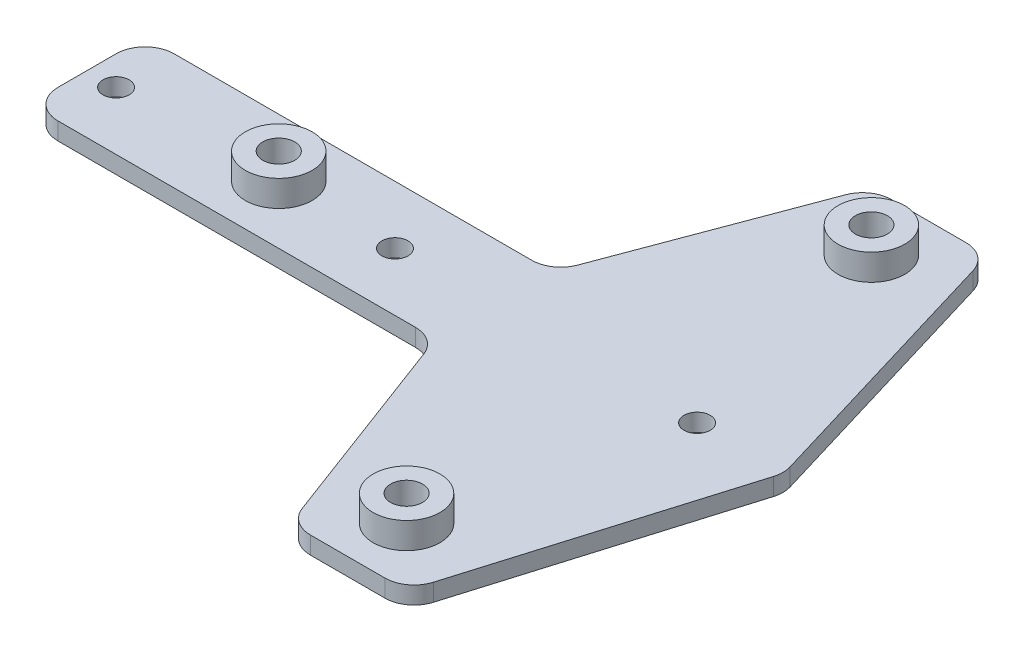
ISO-10303-21;
HEADER;
FILE_DESCRIPTION(('STEP AP214'),'2;1');
FILE_NAME('part.step','',(''),(''),'','','');
FILE_SCHEMA(('AUTOMOTIVE_DESIGN { 1 0 10303 214 1 1 1 1 }'));
ENDSEC;
DATA;
#1=APPLICATION_CONTEXT('core data for automotive mechanical design processes');
#2=APPLICATION_PROTOCOL_DEFINITION('international standard','automotive_design',2000,#1);
#3=PRODUCT_CONTEXT('',#1,'mechanical');
#4=PRODUCT('Part','Part','',(#3));
#5=PRODUCT_RELATED_PRODUCT_CATEGORY('part','',(#4));
#6=PRODUCT_DEFINITION_FORMATION('','',#4);
#7=PRODUCT_DEFINITION_CONTEXT('part definition',#1,'design');
#8=PRODUCT_DEFINITION('design','',#6,#7);
#9=PRODUCT_DEFINITION_SHAPE('','',#8);
#10=(LENGTH_UNIT() NAMED_UNIT(*) SI_UNIT(.MILLI.,.METRE.));
#11=(NAMED_UNIT(*) PLANE_ANGLE_UNIT() SI_UNIT($,.RADIAN.));
#12=(NAMED_UNIT(*) SI_UNIT($,.STERADIAN.) SOLID_ANGLE_UNIT());
#13=UNCERTAINTY_MEASURE_WITH_UNIT(LENGTH_MEASURE(1.E-05),#10,'distance_accuracy_value','');
#14=(GEOMETRIC_REPRESENTATION_CONTEXT(3) GLOBAL_UNCERTAINTY_ASSIGNED_CONTEXT((#13)) GLOBAL_UNIT_ASSIGNED_CONTEXT((#10,
#11,#12)) REPRESENTATION_CONTEXT('',''));
#15=CARTESIAN_POINT('',(0.,0.,0.));
#16=DIRECTION('',(0.,0.,1.));
#17=DIRECTION('',(1.,0.,0.));
#18=AXIS2_PLACEMENT_3D('',#15,#16,#17);
#19=CARTESIAN_POINT('',(6.53499765917655,3.,-15.));
#20=DIRECTION('',(0.,1.,0.));
#21=DIRECTION('',(0.,0.,1.));
#22=AXIS2_PLACEMENT_3D('',#19,#20,#21);
#23=PLANE('',#22);
#24=CARTESIAN_POINT('',(-55.,3.,0.));
#25=DIRECTION('',(0.,1.,0.));
#26=DIRECTION('',(0.,0.,1.));
#27=AXIS2_PLACEMENT_3D('',#24,#25,#26);
#28=CIRCLE('',#27,2.25);
#29=CARTESIAN_POINT('',(-55.,3.,2.25));
#30=VERTEX_POINT('',#29);
#31=EDGE_CURVE('E399',#30,#30,#28,.T.);
#32=ORIENTED_EDGE('',*,*,#31,.F.);
#33=EDGE_LOOP('',(#32));
#34=FACE_BOUND('',#33,.T.);
#35=CARTESIAN_POINT('',(45.,3.,0.));
#36=DIRECTION('',(0.,1.,0.));
#37=DIRECTION('',(0.,0.,1.));
#38=AXIS2_PLACEMENT_3D('',#35,#36,#37);
#39=CIRCLE('',#38,2.25);
#40=CARTESIAN_POINT('',(45.,3.,2.25));
#41=VERTEX_POINT('',#40);
#42=EDGE_CURVE('E400',#41,#41,#39,.T.);
#43=ORIENTED_EDGE('',*,*,#42,.F.);
#44=EDGE_LOOP('',(#43));
#45=FACE_BOUND('',#44,.T.);
#46=CARTESIAN_POINT('',(-7.,3.,0.));
#47=DIRECTION('',(0.,1.,0.));
#48=DIRECTION('',(0.,0.,1.));
#49=AXIS2_PLACEMENT_3D('',#46,#47,#48);
#50=CIRCLE('',#49,2.25);
#51=CARTESIAN_POINT('',(-7.,3.,2.25));
#52=VERTEX_POINT('',#51);
#53=EDGE_CURVE('E410',#52,#52,#50,.T.);
#54=ORIENTED_EDGE('',*,*,#53,.F.);
#55=EDGE_LOOP('',(#54));
#56=FACE_BOUND('',#55,.T.);
#57=CARTESIAN_POINT('',(35.,3.,-40.));
#58=DIRECTION('',(0.,1.,0.));
#59=DIRECTION('',(0.,0.,1.));
#60=AXIS2_PLACEMENT_3D('',#57,#58,#59);
#61=CIRCLE('',#60,5.74999999999999);
#62=CARTESIAN_POINT('',(35.,3.,-34.25));
#63=VERTEX_POINT('',#62);
#64=EDGE_CURVE('E425',#63,#63,#61,.T.);
#65=ORIENTED_EDGE('',*,*,#64,.F.);
#66=EDGE_LOOP('',(#65));
#67=FACE_BOUND('',#66,.T.);
#68=CARTESIAN_POINT('',(6.53499765917655,3.,-15.));
#69=DIRECTION('',(0.,-1.,0.));
#70=DIRECTION('',(0.,0.,1.));
#71=AXIS2_PLACEMENT_3D('',#68,#69,#70);
#72=CIRCLE('',#71,5.);
#73=CARTESIAN_POINT('',(11.2166435470218,3.,-13.244382792058));
#74=VERTEX_POINT('',#73);
#75=CARTESIAN_POINT('',(6.53499765917655,3.,-10.));
#76=VERTEX_POINT('',#75);
#77=EDGE_CURVE('E228',#74,#76,#72,.T.);
#78=ORIENTED_EDGE('',*,*,#77,.T.);
#79=DIRECTION('',(-1.,0.,0.));
#80=VECTOR('',#79,1.);
#81=CARTESIAN_POINT('',(-55.,3.,-10.));
#82=LINE('',#81,#80);
#83=CARTESIAN_POINT('',(-55.,3.,-10.));
#84=VERTEX_POINT('',#83);
#85=EDGE_CURVE('E126',#76,#84,#82,.T.);
#86=ORIENTED_EDGE('',*,*,#85,.T.);
#87=CARTESIAN_POINT('',(-55.,3.,-5.));
#88=DIRECTION('',(0.,1.,0.));
#89=DIRECTION('',(0.,0.,1.));
#90=AXIS2_PLACEMENT_3D('',#87,#88,#89);
#91=CIRCLE('',#90,5.);
#92=CARTESIAN_POINT('',(-60.,3.,-5.));
#93=VERTEX_POINT('',#92);
#94=EDGE_CURVE('E273',#84,#93,#91,.T.);
#95=ORIENTED_EDGE('',*,*,#94,.T.);
#96=DIRECTION('',(0.,0.,1.));
#97=VECTOR('',#96,1.);
#98=CARTESIAN_POINT('',(-60.,3.,5.));
#99=LINE('',#98,#97);
#100=CARTESIAN_POINT('',(-60.,3.,5.));
#101=VERTEX_POINT('',#100);
#102=EDGE_CURVE('E291',#93,#101,#99,.T.);
#103=ORIENTED_EDGE('',*,*,#102,.T.);
#104=CARTESIAN_POINT('',(-55.,3.,5.));
#105=DIRECTION('',(0.,1.,0.));
#106=DIRECTION('',(0.,0.,-1.));
#107=AXIS2_PLACEMENT_3D('',#104,#105,#106);
#108=CIRCLE('',#107,5.);
#109=CARTESIAN_POINT('',(-55.,3.,10.));
#110=VERTEX_POINT('',#109);
#111=EDGE_CURVE('E288',#101,#110,#108,.T.);
#112=ORIENTED_EDGE('',*,*,#111,.T.);
#113=DIRECTION('',(1.,0.,0.));
#114=VECTOR('',#113,1.);
#115=CARTESIAN_POINT('',(6.53499765917655,3.,10.));
#116=LINE('',#115,#114);
#117=CARTESIAN_POINT('',(6.53499765917655,3.,10.));
#118=VERTEX_POINT('',#117);
#119=EDGE_CURVE('E290',#110,#118,#116,.T.);
#120=ORIENTED_EDGE('',*,*,#119,.T.);
#121=CARTESIAN_POINT('',(6.53499765917655,3.,15.));
#122=DIRECTION('',(0.,-1.,0.));
#123=DIRECTION('',(0.,0.,1.));
#124=AXIS2_PLACEMENT_3D('',#121,#122,#123);
#125=CIRCLE('',#124,5.);
#126=CARTESIAN_POINT('',(11.2166435470218,3.,13.244382792058));
#127=VERTEX_POINT('',#126);
#128=EDGE_CURVE('E293',#118,#127,#125,.T.);
#129=ORIENTED_EDGE('',*,*,#128,.T.);
#130=DIRECTION('',(0.351123441588391,0.,0.936329177569045));
#131=VECTOR('',#130,1.);
#132=CARTESIAN_POINT('',(23.7833564529782,3.,46.755617207942));
#133=LINE('',#132,#131);
#134=CARTESIAN_POINT('',(23.7833564529782,3.,46.755617207942));
#135=VERTEX_POINT('',#134);
#136=EDGE_CURVE('E299',#127,#135,#133,.T.);
#137=ORIENTED_EDGE('',*,*,#136,.T.);
#138=CARTESIAN_POINT('',(28.4650023408235,3.,45.));
#139=DIRECTION('',(0.,1.,0.));
#140=DIRECTION('',(0.,0.,-1.));
#141=AXIS2_PLACEMENT_3D('',#138,#139,#140);
#142=CIRCLE('',#141,4.99999999999999);
#143=CARTESIAN_POINT('',(28.4650023408235,3.,50.));
#144=VERTEX_POINT('',#143);
#145=EDGE_CURVE('E301',#135,#144,#142,.T.);
#146=ORIENTED_EDGE('',*,*,#145,.T.);
#147=DIRECTION('',(1.,0.,0.));
#148=VECTOR('',#147,1.);
#149=CARTESIAN_POINT('',(41.2798467455448,3.,50.));
#150=LINE('',#149,#148);
#151=CARTESIAN_POINT('',(41.2798467455448,3.,50.));
#152=VERTEX_POINT('',#151);
#153=EDGE_CURVE('E303',#144,#152,#150,.T.);
#154=ORIENTED_EDGE('',*,*,#153,.T.);
#155=CARTESIAN_POINT('',(41.2798467455448,3.,45.));
#156=DIRECTION('',(0.,1.,0.));
#157=DIRECTION('',(0.,0.,-1.));
#158=AXIS2_PLACEMENT_3D('',#155,#156,#157);
#159=CIRCLE('',#158,4.99999999999999);
#160=CARTESIAN_POINT('',(46.0689781716505,3.,46.4367394278317));
#161=VERTEX_POINT('',#160);
#162=EDGE_CURVE('E305',#152,#161,#159,.T.);
#163=ORIENTED_EDGE('',*,*,#162,.T.);
#164=DIRECTION('',(0.287347885566344,0.,-0.957826285221152));
#165=VECTOR('',#164,1.);
#166=CARTESIAN_POINT('',(59.5689781716505,3.,1.43673942783172));
#167=LINE('',#166,#165);
#168=CARTESIAN_POINT('',(59.5689781716505,3.,1.43673942783172));
#169=VERTEX_POINT('',#168);
#170=EDGE_CURVE('E307',#161,#169,#167,.T.);
#171=ORIENTED_EDGE('',*,*,#170,.T.);
#172=CARTESIAN_POINT('',(54.7798467455447,3.,0.));
#173=DIRECTION('',(0.,1.,0.));
#174=DIRECTION('',(0.,0.,-1.));
#175=AXIS2_PLACEMENT_3D('',#172,#173,#174);
#176=CIRCLE('',#175,5.00000000000001);
#177=CARTESIAN_POINT('',(59.5689781716505,3.,-1.43673942783172));
#178=VERTEX_POINT('',#177);
#179=EDGE_CURVE('E309',#169,#178,#176,.T.);
#180=ORIENTED_EDGE('',*,*,#179,.T.);
#181=DIRECTION('',(-0.287347885566344,0.,-0.957826285221152));
#182=VECTOR('',#181,1.);
#183=CARTESIAN_POINT('',(46.0689781716505,3.,-46.4367394278317));
#184=LINE('',#183,#182);
#185=CARTESIAN_POINT('',(46.0689781716505,3.,-46.4367394278317));
#186=VERTEX_POINT('',#185);
#187=EDGE_CURVE('E311',#178,#186,#184,.T.);
#188=ORIENTED_EDGE('',*,*,#187,.T.);
#189=CARTESIAN_POINT('',(41.2798467455448,3.,-45.));
#190=DIRECTION('',(0.,1.,0.));
#191=DIRECTION('',(0.,0.,-1.));
#192=AXIS2_PLACEMENT_3D('',#189,#190,#191);
#193=CIRCLE('',#192,4.99999999999999);
#194=CARTESIAN_POINT('',(41.2798467455448,3.,-50.));
#195=VERTEX_POINT('',#194);
#196=EDGE_CURVE('E175',#186,#195,#193,.T.);
#197=ORIENTED_EDGE('',*,*,#196,.T.);
#198=DIRECTION('',(-1.,0.,0.));
#199=VECTOR('',#198,1.);
#200=CARTESIAN_POINT('',(28.4650023408235,3.,-50.));
#201=LINE('',#200,#199);
#202=CARTESIAN_POINT('',(28.4650023408235,3.,-50.));
#203=VERTEX_POINT('',#202);
#204=EDGE_CURVE('E169',#195,#203,#201,.T.);
#205=ORIENTED_EDGE('',*,*,#204,.T.);
#206=CARTESIAN_POINT('',(28.4650023408235,3.,-45.));
#207=DIRECTION('',(0.,1.,0.));
#208=DIRECTION('',(0.,0.,-1.));
#209=AXIS2_PLACEMENT_3D('',#206,#207,#208);
#210=CIRCLE('',#209,4.99999999999999);
#211=CARTESIAN_POINT('',(23.7833564529782,3.,-46.755617207942));
#212=VERTEX_POINT('',#211);
#213=EDGE_CURVE('E173',#203,#212,#210,.T.);
#214=ORIENTED_EDGE('',*,*,#213,.T.);
#215=DIRECTION('',(-0.351123441588391,0.,0.936329177569045));
#216=VECTOR('',#215,1.);
#217=CARTESIAN_POINT('',(11.2166435470218,3.,-13.244382792058));
#218=LINE('',#217,#216);
#219=EDGE_CURVE('E53',#212,#74,#218,.T.);
#220=ORIENTED_EDGE('',*,*,#219,.T.);
#221=EDGE_LOOP('',(#78,#86,#95,#103,#112,#120,#129,#137,#146,#154,#163,#171,#180,#188,#197,#205,
#214,#220));
#222=FACE_BOUND('',#221,.T.);
#223=CARTESIAN_POINT('',(-27.,3.,0.));
#224=DIRECTION('',(0.,1.,0.));
#225=DIRECTION('',(0.,0.,1.));
#226=AXIS2_PLACEMENT_3D('',#223,#224,#225);
#227=CIRCLE('',#226,5.75);
#228=CARTESIAN_POINT('',(-27.,3.,5.75));
#229=VERTEX_POINT('',#228);
#230=EDGE_CURVE('E436',#229,#229,#227,.T.);
#231=ORIENTED_EDGE('',*,*,#230,.F.);
#232=EDGE_LOOP('',(#231));
#233=FACE_BOUND('',#232,.T.);
#234=CARTESIAN_POINT('',(35.,3.,40.));
#235=DIRECTION('',(0.,1.,0.));
#236=DIRECTION('',(0.,0.,1.));
#237=AXIS2_PLACEMENT_3D('',#234,#235,#236);
#238=CIRCLE('',#237,5.74999999999999);
#239=CARTESIAN_POINT('',(35.,3.,45.75));
#240=VERTEX_POINT('',#239);
#241=EDGE_CURVE('E416',#240,#240,#238,.T.);
#242=ORIENTED_EDGE('',*,*,#241,.F.);
#243=EDGE_LOOP('',(#242));
#244=FACE_BOUND('',#243,.T.);
#245=ADVANCED_FACE('F36',(#34,#45,#56,#67,#222,#233,#244),#23,.T.);
#246=CARTESIAN_POINT('',(6.53499765917655,3.,-15.));
#247=DIRECTION('',(0.,-1.,0.));
#248=DIRECTION('',(0.,0.,-1.));
#249=AXIS2_PLACEMENT_3D('',#246,#247,#248);
#250=CYLINDRICAL_SURFACE('',#249,5.);
#251=CARTESIAN_POINT('',(6.53499765917655,0.,-15.));
#252=DIRECTION('',(0.,-1.,0.));
#253=DIRECTION('',(0.,0.,1.));
#254=AXIS2_PLACEMENT_3D('',#251,#252,#253);
#255=CIRCLE('',#254,5.);
#256=CARTESIAN_POINT('',(11.2166435470218,0.,-13.244382792058));
#257=VERTEX_POINT('',#256);
#258=CARTESIAN_POINT('',(6.53499765917655,0.,-10.));
#259=VERTEX_POINT('',#258);
#260=EDGE_CURVE('E193',#257,#259,#255,.T.);
#261=ORIENTED_EDGE('',*,*,#260,.T.);
#262=DIRECTION('',(0.,-1.,0.));
#263=VECTOR('',#262,1.);
#264=CARTESIAN_POINT('',(6.53499765917655,3.,-10.));
#265=LINE('',#264,#263);
#266=EDGE_CURVE('E11',#76,#259,#265,.T.);
#267=ORIENTED_EDGE('',*,*,#266,.F.);
#268=ORIENTED_EDGE('',*,*,#77,.F.);
#269=DIRECTION('',(0.,-1.,0.));
#270=VECTOR('',#269,1.);
#271=CARTESIAN_POINT('',(11.2166435470218,3.,-13.244382792058));
#272=LINE('',#271,#270);
#273=EDGE_CURVE('E189',#74,#257,#272,.T.);
#274=ORIENTED_EDGE('',*,*,#273,.T.);
#275=EDGE_LOOP('',(#261,#267,#268,#274));
#276=FACE_BOUND('',#275,.T.);
#277=ADVANCED_FACE('F38',(#276),#250,.F.);
#278=CARTESIAN_POINT('',(-55.,3.,-10.));
#279=DIRECTION('',(0.,0.,1.));
#280=DIRECTION('',(1.,0.,0.));
#281=AXIS2_PLACEMENT_3D('',#278,#279,#280);
#282=PLANE('',#281);
#283=DIRECTION('',(-1.,0.,0.));
#284=VECTOR('',#283,1.);
#285=CARTESIAN_POINT('',(-55.,0.,-10.));
#286=LINE('',#285,#284);
#287=CARTESIAN_POINT('',(-55.,0.,-10.));
#288=VERTEX_POINT('',#287);
#289=EDGE_CURVE('E196',#259,#288,#286,.T.);
#290=ORIENTED_EDGE('',*,*,#289,.T.);
#291=DIRECTION('',(0.,-1.,0.));
#292=VECTOR('',#291,1.);
#293=CARTESIAN_POINT('',(-55.,3.,-10.));
#294=LINE('',#293,#292);
#295=EDGE_CURVE('E45',#84,#288,#294,.T.);
#296=ORIENTED_EDGE('',*,*,#295,.F.);
#297=ORIENTED_EDGE('',*,*,#85,.F.);
#298=ORIENTED_EDGE('',*,*,#266,.T.);
#299=EDGE_LOOP('',(#290,#296,#297,#298));
#300=FACE_BOUND('',#299,.T.);
#301=ADVANCED_FACE('F342',(#300),#282,.F.);
#302=CARTESIAN_POINT('',(-55.,3.,-5.));
#303=DIRECTION('',(0.,-1.,0.));
#304=DIRECTION('',(0.,0.,-1.));
#305=AXIS2_PLACEMENT_3D('',#302,#303,#304);
#306=CYLINDRICAL_SURFACE('',#305,5.);
#307=CARTESIAN_POINT('',(-55.,0.,-5.));
#308=DIRECTION('',(0.,1.,0.));
#309=DIRECTION('',(0.,0.,1.));
#310=AXIS2_PLACEMENT_3D('',#307,#308,#309);
#311=CIRCLE('',#310,5.);
#312=CARTESIAN_POINT('',(-60.,0.,-5.));
#313=VERTEX_POINT('',#312);
#314=EDGE_CURVE('E199',#288,#313,#311,.T.);
#315=ORIENTED_EDGE('',*,*,#314,.T.);
#316=DIRECTION('',(0.,-1.,0.));
#317=VECTOR('',#316,1.);
#318=CARTESIAN_POINT('',(-60.,3.,-5.));
#319=LINE('',#318,#317);
#320=EDGE_CURVE('E265',#93,#313,#319,.T.);
#321=ORIENTED_EDGE('',*,*,#320,.F.);
#322=ORIENTED_EDGE('',*,*,#94,.F.);
#323=ORIENTED_EDGE('',*,*,#295,.T.);
#324=EDGE_LOOP('',(#315,#321,#322,#323));
#325=FACE_BOUND('',#324,.T.);
#326=ADVANCED_FACE('F271',(#325),#306,.T.);
#327=CARTESIAN_POINT('',(-60.,3.,5.));
#328=DIRECTION('',(1.,0.,0.));
#329=DIRECTION('',(0.,0.,-1.));
#330=AXIS2_PLACEMENT_3D('',#327,#328,#329);
#331=PLANE('',#330);
#332=DIRECTION('',(0.,0.,1.));
#333=VECTOR('',#332,1.);
#334=CARTESIAN_POINT('',(-60.,0.,5.));
#335=LINE('',#334,#333);
#336=CARTESIAN_POINT('',(-60.,0.,5.));
#337=VERTEX_POINT('',#336);
#338=EDGE_CURVE('E201',#313,#337,#335,.T.);
#339=ORIENTED_EDGE('',*,*,#338,.T.);
#340=DIRECTION('',(0.,-1.,0.));
#341=VECTOR('',#340,1.);
#342=CARTESIAN_POINT('',(-60.,3.,5.));
#343=LINE('',#342,#341);
#344=EDGE_CURVE('E262',#101,#337,#343,.T.);
#345=ORIENTED_EDGE('',*,*,#344,.F.);
#346=ORIENTED_EDGE('',*,*,#102,.F.);
#347=ORIENTED_EDGE('',*,*,#320,.T.);
#348=EDGE_LOOP('',(#339,#345,#346,#347));
#349=FACE_BOUND('',#348,.T.);
#350=ADVANCED_FACE('F282',(#349),#331,.F.);
#351=CARTESIAN_POINT('',(-55.,3.,5.));
#352=DIRECTION('',(0.,-1.,0.));
#353=DIRECTION('',(0.,0.,-1.));
#354=AXIS2_PLACEMENT_3D('',#351,#352,#353);
#355=CYLINDRICAL_SURFACE('',#354,5.);
#356=CARTESIAN_POINT('',(-55.,0.,5.));
#357=DIRECTION('',(0.,1.,0.));
#358=DIRECTION('',(0.,0.,-1.));
#359=AXIS2_PLACEMENT_3D('',#356,#357,#358);
#360=CIRCLE('',#359,5.);
#361=CARTESIAN_POINT('',(-55.,0.,10.));
#362=VERTEX_POINT('',#361);
#363=EDGE_CURVE('E203',#337,#362,#360,.T.);
#364=ORIENTED_EDGE('',*,*,#363,.T.);
#365=DIRECTION('',(0.,-1.,0.));
#366=VECTOR('',#365,1.);
#367=CARTESIAN_POINT('',(-55.,3.,10.));
#368=LINE('',#367,#366);
#369=EDGE_CURVE('E259',#110,#362,#368,.T.);
#370=ORIENTED_EDGE('',*,*,#369,.F.);
#371=ORIENTED_EDGE('',*,*,#111,.F.);
#372=ORIENTED_EDGE('',*,*,#344,.T.);
#373=EDGE_LOOP('',(#364,#370,#371,#372));
#374=FACE_BOUND('',#373,.T.);
#375=ADVANCED_FACE('F286',(#374),#355,.T.);
#376=CARTESIAN_POINT('',(6.53499765917655,3.,10.));
#377=DIRECTION('',(0.,0.,-1.));
#378=DIRECTION('',(-1.,0.,0.));
#379=AXIS2_PLACEMENT_3D('',#376,#377,#378);
#380=PLANE('',#379);
#381=DIRECTION('',(1.,0.,0.));
#382=VECTOR('',#381,1.);
#383=CARTESIAN_POINT('',(6.53499765917655,0.,10.));
#384=LINE('',#383,#382);
#385=CARTESIAN_POINT('',(6.53499765917655,0.,10.));
#386=VERTEX_POINT('',#385);
#387=EDGE_CURVE('E205',#362,#386,#384,.T.);
#388=ORIENTED_EDGE('',*,*,#387,.T.);
#389=DIRECTION('',(0.,-1.,0.));
#390=VECTOR('',#389,1.);
#391=CARTESIAN_POINT('',(6.53499765917655,3.,10.));
#392=LINE('',#391,#390);
#393=EDGE_CURVE('E256',#118,#386,#392,.T.);
#394=ORIENTED_EDGE('',*,*,#393,.F.);
#395=ORIENTED_EDGE('',*,*,#119,.F.);
#396=ORIENTED_EDGE('',*,*,#369,.T.);
#397=EDGE_LOOP('',(#388,#394,#395,#396));
#398=FACE_BOUND('',#397,.T.);
#399=ADVANCED_FACE('F704',(#398),#380,.F.);
#400=CARTESIAN_POINT('',(6.53499765917655,3.,15.));
#401=DIRECTION('',(0.,-1.,0.));
#402=DIRECTION('',(0.,0.,-1.));
#403=AXIS2_PLACEMENT_3D('',#400,#401,#402);
#404=CYLINDRICAL_SURFACE('',#403,5.);
#405=CARTESIAN_POINT('',(6.53499765917655,0.,15.));
#406=DIRECTION('',(0.,-1.,0.));
#407=DIRECTION('',(0.,0.,1.));
#408=AXIS2_PLACEMENT_3D('',#405,#406,#407);
#409=CIRCLE('',#408,5.);
#410=CARTESIAN_POINT('',(11.2166435470218,0.,13.244382792058));
#411=VERTEX_POINT('',#410);
#412=EDGE_CURVE('E207',#386,#411,#409,.T.);
#413=ORIENTED_EDGE('',*,*,#412,.T.);
#414=DIRECTION('',(0.,-1.,0.));
#415=VECTOR('',#414,1.);
#416=CARTESIAN_POINT('',(11.2166435470218,3.,13.244382792058));
#417=LINE('',#416,#415);
#418=EDGE_CURVE('E253',#127,#411,#417,.T.);
#419=ORIENTED_EDGE('',*,*,#418,.F.);
#420=ORIENTED_EDGE('',*,*,#128,.F.);
#421=ORIENTED_EDGE('',*,*,#393,.T.);
#422=EDGE_LOOP('',(#413,#419,#420,#421));
#423=FACE_BOUND('',#422,.T.);
#424=ADVANCED_FACE('F694',(#423),#404,.F.);
#425=CARTESIAN_POINT('',(23.7833564529782,3.,46.755617207942));
#426=DIRECTION('',(0.936329177569045,0.,-0.351123441588391));
#427=DIRECTION('',(-0.351123441588391,0.,-0.936329177569045));
#428=AXIS2_PLACEMENT_3D('',#425,#426,#427);
#429=PLANE('',#428);
#430=DIRECTION('',(0.351123441588391,0.,0.936329177569045));
#431=VECTOR('',#430,1.);
#432=CARTESIAN_POINT('',(23.7833564529782,0.,46.755617207942));
#433=LINE('',#432,#431);
#434=CARTESIAN_POINT('',(23.7833564529782,0.,46.755617207942));
#435=VERTEX_POINT('',#434);
#436=EDGE_CURVE('E209',#411,#435,#433,.T.);
#437=ORIENTED_EDGE('',*,*,#436,.T.);
#438=DIRECTION('',(0.,-1.,0.));
#439=VECTOR('',#438,1.);
#440=CARTESIAN_POINT('',(23.7833564529782,3.,46.755617207942));
#441=LINE('',#440,#439);
#442=EDGE_CURVE('E250',#135,#435,#441,.T.);
#443=ORIENTED_EDGE('',*,*,#442,.F.);
#444=ORIENTED_EDGE('',*,*,#136,.F.);
#445=ORIENTED_EDGE('',*,*,#418,.T.);
#446=EDGE_LOOP('',(#437,#443,#444,#445));
#447=FACE_BOUND('',#446,.T.);
#448=ADVANCED_FACE('F684',(#447),#429,.F.);
#449=CARTESIAN_POINT('',(28.4650023408235,3.,45.));
#450=DIRECTION('',(0.,-1.,0.));
#451=DIRECTION('',(0.,0.,-1.));
#452=AXIS2_PLACEMENT_3D('',#449,#450,#451);
#453=CYLINDRICAL_SURFACE('',#452,4.99999999999999);
#454=CARTESIAN_POINT('',(28.4650023408235,0.,45.));
#455=DIRECTION('',(0.,1.,0.));
#456=DIRECTION('',(0.,0.,-1.));
#457=AXIS2_PLACEMENT_3D('',#454,#455,#456);
#458=CIRCLE('',#457,4.99999999999999);
#459=CARTESIAN_POINT('',(28.4650023408235,0.,50.));
#460=VERTEX_POINT('',#459);
#461=EDGE_CURVE('E211',#435,#460,#458,.T.);
#462=ORIENTED_EDGE('',*,*,#461,.T.);
#463=DIRECTION('',(0.,-1.,0.));
#464=VECTOR('',#463,1.);
#465=CARTESIAN_POINT('',(28.4650023408235,3.,50.));
#466=LINE('',#465,#464);
#467=EDGE_CURVE('E247',#144,#460,#466,.T.);
#468=ORIENTED_EDGE('',*,*,#467,.F.);
#469=ORIENTED_EDGE('',*,*,#145,.F.);
#470=ORIENTED_EDGE('',*,*,#442,.T.);
#471=EDGE_LOOP('',(#462,#468,#469,#470));
#472=FACE_BOUND('',#471,.T.);
#473=ADVANCED_FACE('F674',(#472),#453,.T.);
#474=CARTESIAN_POINT('',(41.2798467455448,3.,50.));
#475=DIRECTION('',(0.,0.,-1.));
#476=DIRECTION('',(-1.,0.,0.));
#477=AXIS2_PLACEMENT_3D('',#474,#475,#476);
#478=PLANE('',#477);
#479=DIRECTION('',(1.,0.,0.));
#480=VECTOR('',#479,1.);
#481=CARTESIAN_POINT('',(41.2798467455448,0.,50.));
#482=LINE('',#481,#480);
#483=CARTESIAN_POINT('',(41.2798467455448,0.,50.));
#484=VERTEX_POINT('',#483);
#485=EDGE_CURVE('E213',#460,#484,#482,.T.);
#486=ORIENTED_EDGE('',*,*,#485,.T.);
#487=DIRECTION('',(0.,-1.,0.));
#488=VECTOR('',#487,1.);
#489=CARTESIAN_POINT('',(41.2798467455448,3.,50.));
#490=LINE('',#489,#488);
#491=EDGE_CURVE('E244',#152,#484,#490,.T.);
#492=ORIENTED_EDGE('',*,*,#491,.F.);
#493=ORIENTED_EDGE('',*,*,#153,.F.);
#494=ORIENTED_EDGE('',*,*,#467,.T.);
#495=EDGE_LOOP('',(#486,#492,#493,#494));
#496=FACE_BOUND('',#495,.T.);
#497=ADVANCED_FACE('F664',(#496),#478,.F.);
#498=CARTESIAN_POINT('',(41.2798467455448,3.,45.));
#499=DIRECTION('',(0.,-1.,0.));
#500=DIRECTION('',(0.,0.,-1.));
#501=AXIS2_PLACEMENT_3D('',#498,#499,#500);
#502=CYLINDRICAL_SURFACE('',#501,4.99999999999999);
#503=CARTESIAN_POINT('',(41.2798467455448,0.,45.));
#504=DIRECTION('',(0.,1.,0.));
#505=DIRECTION('',(0.,0.,-1.));
#506=AXIS2_PLACEMENT_3D('',#503,#504,#505);
#507=CIRCLE('',#506,4.99999999999999);
#508=CARTESIAN_POINT('',(46.0689781716505,0.,46.4367394278317));
#509=VERTEX_POINT('',#508);
#510=EDGE_CURVE('E215',#484,#509,#507,.T.);
#511=ORIENTED_EDGE('',*,*,#510,.T.);
#512=DIRECTION('',(0.,-1.,0.));
#513=VECTOR('',#512,1.);
#514=CARTESIAN_POINT('',(46.0689781716505,3.,46.4367394278317));
#515=LINE('',#514,#513);
#516=EDGE_CURVE('E241',#161,#509,#515,.T.);
#517=ORIENTED_EDGE('',*,*,#516,.F.);
#518=ORIENTED_EDGE('',*,*,#162,.F.);
#519=ORIENTED_EDGE('',*,*,#491,.T.);
#520=EDGE_LOOP('',(#511,#517,#518,#519));
#521=FACE_BOUND('',#520,.T.);
#522=ADVANCED_FACE('F654',(#521),#502,.T.);
#523=CARTESIAN_POINT('',(59.5689781716505,3.,1.43673942783172));
#524=DIRECTION('',(-0.957826285221152,0.,-0.287347885566344));
#525=DIRECTION('',(-0.287347885566344,0.,0.957826285221152));
#526=AXIS2_PLACEMENT_3D('',#523,#524,#525);
#527=PLANE('',#526);
#528=DIRECTION('',(0.287347885566344,0.,-0.957826285221152));
#529=VECTOR('',#528,1.);
#530=CARTESIAN_POINT('',(59.5689781716505,0.,1.43673942783172));
#531=LINE('',#530,#529);
#532=CARTESIAN_POINT('',(59.5689781716505,0.,1.43673942783172));
#533=VERTEX_POINT('',#532);
#534=EDGE_CURVE('E217',#509,#533,#531,.T.);
#535=ORIENTED_EDGE('',*,*,#534,.T.);
#536=DIRECTION('',(0.,-1.,0.));
#537=VECTOR('',#536,1.);
#538=CARTESIAN_POINT('',(59.5689781716505,3.,1.43673942783172));
#539=LINE('',#538,#537);
#540=EDGE_CURVE('E238',#169,#533,#539,.T.);
#541=ORIENTED_EDGE('',*,*,#540,.F.);
#542=ORIENTED_EDGE('',*,*,#170,.F.);
#543=ORIENTED_EDGE('',*,*,#516,.T.);
#544=EDGE_LOOP('',(#535,#541,#542,#543));
#545=FACE_BOUND('',#544,.T.);
#546=ADVANCED_FACE('F644',(#545),#527,.F.);
#547=CARTESIAN_POINT('',(54.7798467455447,3.,0.));
#548=DIRECTION('',(0.,-1.,0.));
#549=DIRECTION('',(0.,0.,-1.));
#550=AXIS2_PLACEMENT_3D('',#547,#548,#549);
#551=CYLINDRICAL_SURFACE('',#550,5.00000000000001);
#552=CARTESIAN_POINT('',(54.7798467455447,0.,0.));
#553=DIRECTION('',(0.,1.,0.));
#554=DIRECTION('',(0.,0.,-1.));
#555=AXIS2_PLACEMENT_3D('',#552,#553,#554);
#556=CIRCLE('',#555,5.00000000000001);
#557=CARTESIAN_POINT('',(59.5689781716505,0.,-1.43673942783172));
#558=VERTEX_POINT('',#557);
#559=EDGE_CURVE('E219',#533,#558,#556,.T.);
#560=ORIENTED_EDGE('',*,*,#559,.T.);
#561=DIRECTION('',(0.,-1.,0.));
#562=VECTOR('',#561,1.);
#563=CARTESIAN_POINT('',(59.5689781716505,3.,-1.43673942783172));
#564=LINE('',#563,#562);
#565=EDGE_CURVE('E235',#178,#558,#564,.T.);
#566=ORIENTED_EDGE('',*,*,#565,.F.);
#567=ORIENTED_EDGE('',*,*,#179,.F.);
#568=ORIENTED_EDGE('',*,*,#540,.T.);
#569=EDGE_LOOP('',(#560,#566,#567,#568));
#570=FACE_BOUND('',#569,.T.);
#571=ADVANCED_FACE('F635',(#570),#551,.T.);
#572=CARTESIAN_POINT('',(46.0689781716505,3.,-46.4367394278317));
#573=DIRECTION('',(-0.957826285221152,0.,0.287347885566344));
#574=DIRECTION('',(0.287347885566344,0.,0.957826285221152));
#575=AXIS2_PLACEMENT_3D('',#572,#573,#574);
#576=PLANE('',#575);
#577=DIRECTION('',(-0.287347885566344,0.,-0.957826285221152));
#578=VECTOR('',#577,1.);
#579=CARTESIAN_POINT('',(46.0689781716505,0.,-46.4367394278317));
#580=LINE('',#579,#578);
#581=CARTESIAN_POINT('',(46.0689781716505,0.,-46.4367394278317));
#582=VERTEX_POINT('',#581);
#583=EDGE_CURVE('E221',#558,#582,#580,.T.);
#584=ORIENTED_EDGE('',*,*,#583,.T.);
#585=DIRECTION('',(0.,-1.,0.));
#586=VECTOR('',#585,1.);
#587=CARTESIAN_POINT('',(46.0689781716505,3.,-46.4367394278317));
#588=LINE('',#587,#586);
#589=EDGE_CURVE('E232',#186,#582,#588,.T.);
#590=ORIENTED_EDGE('',*,*,#589,.F.);
#591=ORIENTED_EDGE('',*,*,#187,.F.);
#592=ORIENTED_EDGE('',*,*,#565,.T.);
#593=EDGE_LOOP('',(#584,#590,#591,#592));
#594=FACE_BOUND('',#593,.T.);
#595=ADVANCED_FACE('F317',(#594),#576,.F.);
#596=CARTESIAN_POINT('',(41.2798467455448,3.,-45.));
#597=DIRECTION('',(0.,-1.,0.));
#598=DIRECTION('',(0.,0.,-1.));
#599=AXIS2_PLACEMENT_3D('',#596,#597,#598);
#600=CYLINDRICAL_SURFACE('',#599,4.99999999999999);
#601=CARTESIAN_POINT('',(41.2798467455448,0.,-45.));
#602=DIRECTION('',(0.,1.,0.));
#603=DIRECTION('',(0.,0.,-1.));
#604=AXIS2_PLACEMENT_3D('',#601,#602,#603);
#605=CIRCLE('',#604,4.99999999999999);
#606=CARTESIAN_POINT('',(41.2798467455448,0.,-50.));
#607=VERTEX_POINT('',#606);
#608=EDGE_CURVE('E223',#582,#607,#605,.T.);
#609=ORIENTED_EDGE('',*,*,#608,.T.);
#610=DIRECTION('',(0.,-1.,0.));
#611=VECTOR('',#610,1.);
#612=CARTESIAN_POINT('',(41.2798467455448,3.,-50.));
#613=LINE('',#612,#611);
#614=EDGE_CURVE('E184',#195,#607,#613,.T.);
#615=ORIENTED_EDGE('',*,*,#614,.F.);
#616=ORIENTED_EDGE('',*,*,#196,.F.);
#617=ORIENTED_EDGE('',*,*,#589,.T.);
#618=EDGE_LOOP('',(#609,#615,#616,#617));
#619=FACE_BOUND('',#618,.T.);
#620=ADVANCED_FACE('F321',(#619),#600,.T.);
#621=CARTESIAN_POINT('',(28.4650023408235,3.,-50.));
#622=DIRECTION('',(0.,0.,1.));
#623=DIRECTION('',(1.,0.,0.));
#624=AXIS2_PLACEMENT_3D('',#621,#622,#623);
#625=PLANE('',#624);
#626=DIRECTION('',(-1.,0.,0.));
#627=VECTOR('',#626,1.);
#628=CARTESIAN_POINT('',(28.4650023408235,0.,-50.));
#629=LINE('',#628,#627);
#630=CARTESIAN_POINT('',(28.4650023408235,0.,-50.));
#631=VERTEX_POINT('',#630);
#632=EDGE_CURVE('E183',#607,#631,#629,.T.);
#633=ORIENTED_EDGE('',*,*,#632,.T.);
#634=DIRECTION('',(0.,-1.,0.));
#635=VECTOR('',#634,1.);
#636=CARTESIAN_POINT('',(28.4650023408235,3.,-50.));
#637=LINE('',#636,#635);
#638=EDGE_CURVE('E180',#203,#631,#637,.T.);
#639=ORIENTED_EDGE('',*,*,#638,.F.);
#640=ORIENTED_EDGE('',*,*,#204,.F.);
#641=ORIENTED_EDGE('',*,*,#614,.T.);
#642=EDGE_LOOP('',(#633,#639,#640,#641));
#643=FACE_BOUND('',#642,.T.);
#644=ADVANCED_FACE('F181',(#643),#625,.F.);
#645=CARTESIAN_POINT('',(28.4650023408235,3.,-45.));
#646=DIRECTION('',(0.,-1.,0.));
#647=DIRECTION('',(0.,0.,-1.));
#648=AXIS2_PLACEMENT_3D('',#645,#646,#647);
#649=CYLINDRICAL_SURFACE('',#648,4.99999999999999);
#650=CARTESIAN_POINT('',(28.4650023408235,0.,-45.));
#651=DIRECTION('',(0.,1.,0.));
#652=DIRECTION('',(0.,0.,-1.));
#653=AXIS2_PLACEMENT_3D('',#650,#651,#652);
#654=CIRCLE('',#653,4.99999999999999);
#655=CARTESIAN_POINT('',(23.7833564529782,0.,-46.755617207942));
#656=VERTEX_POINT('',#655);
#657=EDGE_CURVE('E112',#631,#656,#654,.T.);
#658=ORIENTED_EDGE('',*,*,#657,.T.);
#659=DIRECTION('',(0.,-1.,0.));
#660=VECTOR('',#659,1.);
#661=CARTESIAN_POINT('',(23.7833564529782,3.,-46.755617207942));
#662=LINE('',#661,#660);
#663=EDGE_CURVE('E185',#212,#656,#662,.T.);
#664=ORIENTED_EDGE('',*,*,#663,.F.);
#665=ORIENTED_EDGE('',*,*,#213,.F.);
#666=ORIENTED_EDGE('',*,*,#638,.T.);
#667=EDGE_LOOP('',(#658,#664,#665,#666));
#668=FACE_BOUND('',#667,.T.);
#669=ADVANCED_FACE('F187',(#668),#649,.T.);
#670=CARTESIAN_POINT('',(11.2166435470218,3.,-13.244382792058));
#671=DIRECTION('',(0.936329177569045,0.,0.351123441588391));
#672=DIRECTION('',(0.351123441588391,0.,-0.936329177569045));
#673=AXIS2_PLACEMENT_3D('',#670,#671,#672);
#674=PLANE('',#673);
#675=DIRECTION('',(-0.351123441588391,0.,0.936329177569045));
#676=VECTOR('',#675,1.);
#677=CARTESIAN_POINT('',(11.2166435470218,0.,-13.244382792058));
#678=LINE('',#677,#676);
#679=EDGE_CURVE('E118',#656,#257,#678,.T.);
#680=ORIENTED_EDGE('',*,*,#679,.T.);
#681=ORIENTED_EDGE('',*,*,#273,.F.);
#682=ORIENTED_EDGE('',*,*,#219,.F.);
#683=ORIENTED_EDGE('',*,*,#663,.T.);
#684=EDGE_LOOP('',(#680,#681,#682,#683));
#685=FACE_BOUND('',#684,.T.);
#686=ADVANCED_FACE('F325',(#685),#674,.F.);
#687=CARTESIAN_POINT('',(6.53499765917655,0.,-15.));
#688=DIRECTION('',(0.,1.,0.));
#689=DIRECTION('',(0.,0.,1.));
#690=AXIS2_PLACEMENT_3D('',#687,#688,#689);
#691=PLANE('',#690);
#692=CARTESIAN_POINT('',(-55.,0.,0.));
#693=DIRECTION('',(0.,1.,0.));
#694=DIRECTION('',(0.,0.,1.));
#695=AXIS2_PLACEMENT_3D('',#692,#693,#694);
#696=CIRCLE('',#695,2.25);
#697=CARTESIAN_POINT('',(-55.,0.,2.25));
#698=VERTEX_POINT('',#697);
#699=EDGE_CURVE('E397',#698,#698,#696,.T.);
#700=ORIENTED_EDGE('',*,*,#699,.T.);
#701=EDGE_LOOP('',(#700));
#702=FACE_BOUND('',#701,.T.);
#703=CARTESIAN_POINT('',(45.,0.,0.));
#704=DIRECTION('',(0.,1.,0.));
#705=DIRECTION('',(0.,0.,1.));
#706=AXIS2_PLACEMENT_3D('',#703,#704,#705);
#707=CIRCLE('',#706,2.25);
#708=CARTESIAN_POINT('',(45.,0.,2.25));
#709=VERTEX_POINT('',#708);
#710=EDGE_CURVE('E405',#709,#709,#707,.T.);
#711=ORIENTED_EDGE('',*,*,#710,.T.);
#712=EDGE_LOOP('',(#711));
#713=FACE_BOUND('',#712,.T.);
#714=CARTESIAN_POINT('',(-7.,0.,0.));
#715=DIRECTION('',(0.,1.,0.));
#716=DIRECTION('',(0.,0.,1.));
#717=AXIS2_PLACEMENT_3D('',#714,#715,#716);
#718=CIRCLE('',#717,2.25);
#719=CARTESIAN_POINT('',(-7.,0.,2.25));
#720=VERTEX_POINT('',#719);
#721=EDGE_CURVE('E413',#720,#720,#718,.T.);
#722=ORIENTED_EDGE('',*,*,#721,.T.);
#723=EDGE_LOOP('',(#722));
#724=FACE_BOUND('',#723,.T.);
#725=CARTESIAN_POINT('',(-27.,0.,0.));
#726=DIRECTION('',(0.,1.,0.));
#727=DIRECTION('',(0.,0.,1.));
#728=AXIS2_PLACEMENT_3D('',#725,#726,#727);
#729=CIRCLE('',#728,2.75);
#730=CARTESIAN_POINT('',(-27.,0.,2.75));
#731=VERTEX_POINT('',#730);
#732=EDGE_CURVE('E197',#731,#731,#729,.T.);
#733=ORIENTED_EDGE('',*,*,#732,.T.);
#734=EDGE_LOOP('',(#733));
#735=FACE_BOUND('',#734,.T.);
#736=CARTESIAN_POINT('',(35.,0.,-40.));
#737=DIRECTION('',(0.,1.,0.));
#738=DIRECTION('',(0.,0.,1.));
#739=AXIS2_PLACEMENT_3D('',#736,#737,#738);
#740=CIRCLE('',#739,2.75);
#741=CARTESIAN_POINT('',(35.,0.,-37.25));
#742=VERTEX_POINT('',#741);
#743=EDGE_CURVE('E445',#742,#742,#740,.T.);
#744=ORIENTED_EDGE('',*,*,#743,.T.);
#745=EDGE_LOOP('',(#744));
#746=FACE_BOUND('',#745,.T.);
#747=CARTESIAN_POINT('',(35.,0.,40.));
#748=DIRECTION('',(0.,1.,0.));
#749=DIRECTION('',(0.,0.,1.));
#750=AXIS2_PLACEMENT_3D('',#747,#748,#749);
#751=CIRCLE('',#750,2.75);
#752=CARTESIAN_POINT('',(35.,0.,42.75));
#753=VERTEX_POINT('',#752);
#754=EDGE_CURVE('E440',#753,#753,#751,.T.);
#755=ORIENTED_EDGE('',*,*,#754,.T.);
#756=EDGE_LOOP('',(#755));
#757=FACE_BOUND('',#756,.T.);
#758=ORIENTED_EDGE('',*,*,#260,.F.);
#759=ORIENTED_EDGE('',*,*,#679,.F.);
#760=ORIENTED_EDGE('',*,*,#657,.F.);
#761=ORIENTED_EDGE('',*,*,#632,.F.);
#762=ORIENTED_EDGE('',*,*,#608,.F.);
#763=ORIENTED_EDGE('',*,*,#583,.F.);
#764=ORIENTED_EDGE('',*,*,#559,.F.);
#765=ORIENTED_EDGE('',*,*,#534,.F.);
#766=ORIENTED_EDGE('',*,*,#510,.F.);
#767=ORIENTED_EDGE('',*,*,#485,.F.);
#768=ORIENTED_EDGE('',*,*,#461,.F.);
#769=ORIENTED_EDGE('',*,*,#436,.F.);
#770=ORIENTED_EDGE('',*,*,#412,.F.);
#771=ORIENTED_EDGE('',*,*,#387,.F.);
#772=ORIENTED_EDGE('',*,*,#363,.F.);
#773=ORIENTED_EDGE('',*,*,#338,.F.);
#774=ORIENTED_EDGE('',*,*,#314,.F.);
#775=ORIENTED_EDGE('',*,*,#289,.F.);
#776=EDGE_LOOP('',(#758,#759,#760,#761,#762,#763,#764,#765,#766,#767,#768,#769,#770,#771,#772,
#773,#774,#775));
#777=FACE_BOUND('',#776,.T.);
#778=ADVANCED_FACE('F277',(#702,#713,#724,#735,#746,#757,#777),#691,.F.);
#779=CARTESIAN_POINT('',(35.,0.,40.));
#780=DIRECTION('',(0.,1.,0.));
#781=DIRECTION('',(0.,0.,1.));
#782=AXIS2_PLACEMENT_3D('',#779,#780,#781);
#783=CYLINDRICAL_SURFACE('',#782,2.75);
#784=ORIENTED_EDGE('',*,*,#754,.F.);
#785=EDGE_LOOP('',(#784));
#786=FACE_BOUND('',#785,.T.);
#787=CARTESIAN_POINT('',(35.,7.5,40.));
#788=DIRECTION('',(0.,1.,0.));
#789=DIRECTION('',(0.,0.,1.));
#790=AXIS2_PLACEMENT_3D('',#787,#788,#789);
#791=CIRCLE('',#790,2.74999999999999);
#792=CARTESIAN_POINT('',(35.,7.5,42.75));
#793=VERTEX_POINT('',#792);
#794=EDGE_CURVE('E419',#793,#793,#791,.T.);
#795=ORIENTED_EDGE('',*,*,#794,.T.);
#796=EDGE_LOOP('',(#795));
#797=FACE_BOUND('',#796,.T.);
#798=ADVANCED_FACE('F332',(#786,#797),#783,.F.);
#799=CARTESIAN_POINT('',(35.,0.,-40.));
#800=DIRECTION('',(0.,1.,0.));
#801=DIRECTION('',(0.,0.,1.));
#802=AXIS2_PLACEMENT_3D('',#799,#800,#801);
#803=CYLINDRICAL_SURFACE('',#802,2.75);
#804=ORIENTED_EDGE('',*,*,#743,.F.);
#805=EDGE_LOOP('',(#804));
#806=FACE_BOUND('',#805,.T.);
#807=CARTESIAN_POINT('',(35.,7.5,-40.));
#808=DIRECTION('',(0.,1.,0.));
#809=DIRECTION('',(0.,0.,1.));
#810=AXIS2_PLACEMENT_3D('',#807,#808,#809);
#811=CIRCLE('',#810,2.74999999999999);
#812=CARTESIAN_POINT('',(35.,7.5,-37.25));
#813=VERTEX_POINT('',#812);
#814=EDGE_CURVE('E428',#813,#813,#811,.T.);
#815=ORIENTED_EDGE('',*,*,#814,.T.);
#816=EDGE_LOOP('',(#815));
#817=FACE_BOUND('',#816,.T.);
#818=ADVANCED_FACE('F348',(#806,#817),#803,.F.);
#819=CARTESIAN_POINT('',(-27.,0.,0.));
#820=DIRECTION('',(0.,1.,0.));
#821=DIRECTION('',(0.,0.,1.));
#822=AXIS2_PLACEMENT_3D('',#819,#820,#821);
#823=CYLINDRICAL_SURFACE('',#822,2.75);
#824=ORIENTED_EDGE('',*,*,#732,.F.);
#825=EDGE_LOOP('',(#824));
#826=FACE_BOUND('',#825,.T.);
#827=CARTESIAN_POINT('',(-27.,7.5,0.));
#828=DIRECTION('',(0.,1.,0.));
#829=DIRECTION('',(0.,0.,1.));
#830=AXIS2_PLACEMENT_3D('',#827,#828,#829);
#831=CIRCLE('',#830,2.75);
#832=CARTESIAN_POINT('',(-27.,7.5,2.75));
#833=VERTEX_POINT('',#832);
#834=EDGE_CURVE('E433',#833,#833,#831,.T.);
#835=ORIENTED_EDGE('',*,*,#834,.T.);
#836=EDGE_LOOP('',(#835));
#837=FACE_BOUND('',#836,.T.);
#838=ADVANCED_FACE('F352',(#826,#837),#823,.F.);
#839=CARTESIAN_POINT('',(-27.,7.5,0.));
#840=DIRECTION('',(0.,1.,0.));
#841=DIRECTION('',(0.,0.,1.));
#842=AXIS2_PLACEMENT_3D('',#839,#840,#841);
#843=PLANE('',#842);
#844=CARTESIAN_POINT('',(-27.,7.5,0.));
#845=DIRECTION('',(0.,1.,0.));
#846=DIRECTION('',(0.,0.,1.));
#847=AXIS2_PLACEMENT_3D('',#844,#845,#846);
#848=CIRCLE('',#847,5.75);
#849=CARTESIAN_POINT('',(-27.,7.5,5.75));
#850=VERTEX_POINT('',#849);
#851=EDGE_CURVE('E437',#850,#850,#848,.T.);
#852=ORIENTED_EDGE('',*,*,#851,.T.);
#853=EDGE_LOOP('',(#852));
#854=FACE_BOUND('',#853,.T.);
#855=ORIENTED_EDGE('',*,*,#834,.F.);
#856=EDGE_LOOP('',(#855));
#857=FACE_BOUND('',#856,.T.);
#858=ADVANCED_FACE('F356',(#854,#857),#843,.T.);
#859=CARTESIAN_POINT('',(-27.,7.5,0.));
#860=DIRECTION('',(0.,-1.,0.));
#861=DIRECTION('',(0.,0.,-1.));
#862=AXIS2_PLACEMENT_3D('',#859,#860,#861);
#863=CYLINDRICAL_SURFACE('',#862,5.75);
#864=ORIENTED_EDGE('',*,*,#851,.F.);
#865=EDGE_LOOP('',(#864));
#866=FACE_BOUND('',#865,.T.);
#867=ORIENTED_EDGE('',*,*,#230,.T.);
#868=EDGE_LOOP('',(#867));
#869=FACE_BOUND('',#868,.T.);
#870=ADVANCED_FACE('F358',(#866,#869),#863,.T.);
#871=CARTESIAN_POINT('',(35.,7.5,-40.));
#872=DIRECTION('',(0.,1.,0.));
#873=DIRECTION('',(0.,0.,1.));
#874=AXIS2_PLACEMENT_3D('',#871,#872,#873);
#875=PLANE('',#874);
#876=CARTESIAN_POINT('',(35.,7.5,-40.));
#877=DIRECTION('',(0.,1.,0.));
#878=DIRECTION('',(0.,0.,1.));
#879=AXIS2_PLACEMENT_3D('',#876,#877,#878);
#880=CIRCLE('',#879,5.74999999999999);
#881=CARTESIAN_POINT('',(35.,7.5,-34.25));
#882=VERTEX_POINT('',#881);
#883=EDGE_CURVE('E424',#882,#882,#880,.T.);
#884=ORIENTED_EDGE('',*,*,#883,.T.);
#885=EDGE_LOOP('',(#884));
#886=FACE_BOUND('',#885,.T.);
#887=ORIENTED_EDGE('',*,*,#814,.F.);
#888=EDGE_LOOP('',(#887));
#889=FACE_BOUND('',#888,.T.);
#890=ADVANCED_FACE('F361',(#886,#889),#875,.T.);
#891=CARTESIAN_POINT('',(35.,7.5,-40.));
#892=DIRECTION('',(0.,-1.,0.));
#893=DIRECTION('',(0.,0.,-1.));
#894=AXIS2_PLACEMENT_3D('',#891,#892,#893);
#895=CYLINDRICAL_SURFACE('',#894,5.74999999999999);
#896=ORIENTED_EDGE('',*,*,#883,.F.);
#897=EDGE_LOOP('',(#896));
#898=FACE_BOUND('',#897,.T.);
#899=ORIENTED_EDGE('',*,*,#64,.T.);
#900=EDGE_LOOP('',(#899));
#901=FACE_BOUND('',#900,.T.);
#902=ADVANCED_FACE('F368',(#898,#901),#895,.T.);
#903=CARTESIAN_POINT('',(35.,7.5,40.));
#904=DIRECTION('',(0.,1.,0.));
#905=DIRECTION('',(0.,0.,1.));
#906=AXIS2_PLACEMENT_3D('',#903,#904,#905);
#907=PLANE('',#906);
#908=CARTESIAN_POINT('',(35.,7.5,40.));
#909=DIRECTION('',(0.,1.,0.));
#910=DIRECTION('',(0.,0.,1.));
#911=AXIS2_PLACEMENT_3D('',#908,#909,#910);
#912=CIRCLE('',#911,5.74999999999999);
#913=CARTESIAN_POINT('',(35.,7.5,45.75));
#914=VERTEX_POINT('',#913);
#915=EDGE_CURVE('E402',#914,#914,#912,.T.);
#916=ORIENTED_EDGE('',*,*,#915,.T.);
#917=EDGE_LOOP('',(#916));
#918=FACE_BOUND('',#917,.T.);
#919=ORIENTED_EDGE('',*,*,#794,.F.);
#920=EDGE_LOOP('',(#919));
#921=FACE_BOUND('',#920,.T.);
#922=ADVANCED_FACE('F372',(#918,#921),#907,.T.);
#923=CARTESIAN_POINT('',(35.,7.5,40.));
#924=DIRECTION('',(0.,-1.,0.));
#925=DIRECTION('',(0.,0.,-1.));
#926=AXIS2_PLACEMENT_3D('',#923,#924,#925);
#927=CYLINDRICAL_SURFACE('',#926,5.74999999999999);
#928=ORIENTED_EDGE('',*,*,#915,.F.);
#929=EDGE_LOOP('',(#928));
#930=FACE_BOUND('',#929,.T.);
#931=ORIENTED_EDGE('',*,*,#241,.T.);
#932=EDGE_LOOP('',(#931));
#933=FACE_BOUND('',#932,.T.);
#934=ADVANCED_FACE('F376',(#930,#933),#927,.T.);
#935=CARTESIAN_POINT('',(-7.,0.,0.));
#936=DIRECTION('',(0.,1.,0.));
#937=DIRECTION('',(0.,0.,1.));
#938=AXIS2_PLACEMENT_3D('',#935,#936,#937);
#939=CYLINDRICAL_SURFACE('',#938,2.25);
#940=ORIENTED_EDGE('',*,*,#721,.F.);
#941=EDGE_LOOP('',(#940));
#942=FACE_BOUND('',#941,.T.);
#943=ORIENTED_EDGE('',*,*,#53,.T.);
#944=EDGE_LOOP('',(#943));
#945=FACE_BOUND('',#944,.T.);
#946=ADVANCED_FACE('F380',(#942,#945),#939,.F.);
#947=CARTESIAN_POINT('',(45.,0.,0.));
#948=DIRECTION('',(0.,1.,0.));
#949=DIRECTION('',(0.,0.,1.));
#950=AXIS2_PLACEMENT_3D('',#947,#948,#949);
#951=CYLINDRICAL_SURFACE('',#950,2.25);
#952=ORIENTED_EDGE('',*,*,#710,.F.);
#953=EDGE_LOOP('',(#952));
#954=FACE_BOUND('',#953,.T.);
#955=ORIENTED_EDGE('',*,*,#42,.T.);
#956=EDGE_LOOP('',(#955));
#957=FACE_BOUND('',#956,.T.);
#958=ADVANCED_FACE('F384',(#954,#957),#951,.F.);
#959=CARTESIAN_POINT('',(-55.,0.,0.));
#960=DIRECTION('',(0.,1.,0.));
#961=DIRECTION('',(0.,0.,1.));
#962=AXIS2_PLACEMENT_3D('',#959,#960,#961);
#963=CYLINDRICAL_SURFACE('',#962,2.25);
#964=ORIENTED_EDGE('',*,*,#699,.F.);
#965=EDGE_LOOP('',(#964));
#966=FACE_BOUND('',#965,.T.);
#967=ORIENTED_EDGE('',*,*,#31,.T.);
#968=EDGE_LOOP('',(#967));
#969=FACE_BOUND('',#968,.T.);
#970=ADVANCED_FACE('F388',(#966,#969),#963,.F.);
#971=CLOSED_SHELL('',(#245,#277,#301,#326,#350,#375,#399,#424,#448,#473,#497,#522,#546,#571,
#595,#620,#644,#669,#686,#778,#798,#818,#838,#858,#870,#890,#902,#922,#934,#946,#958,#970));
#972=MANIFOLD_SOLID_BREP('B2',#971);
#973=ADVANCED_BREP_SHAPE_REPRESENTATION('',(#18,#972),#14);
#974=SHAPE_DEFINITION_REPRESENTATION(#9,#973);
ENDSEC;
END-ISO-10303-21;
